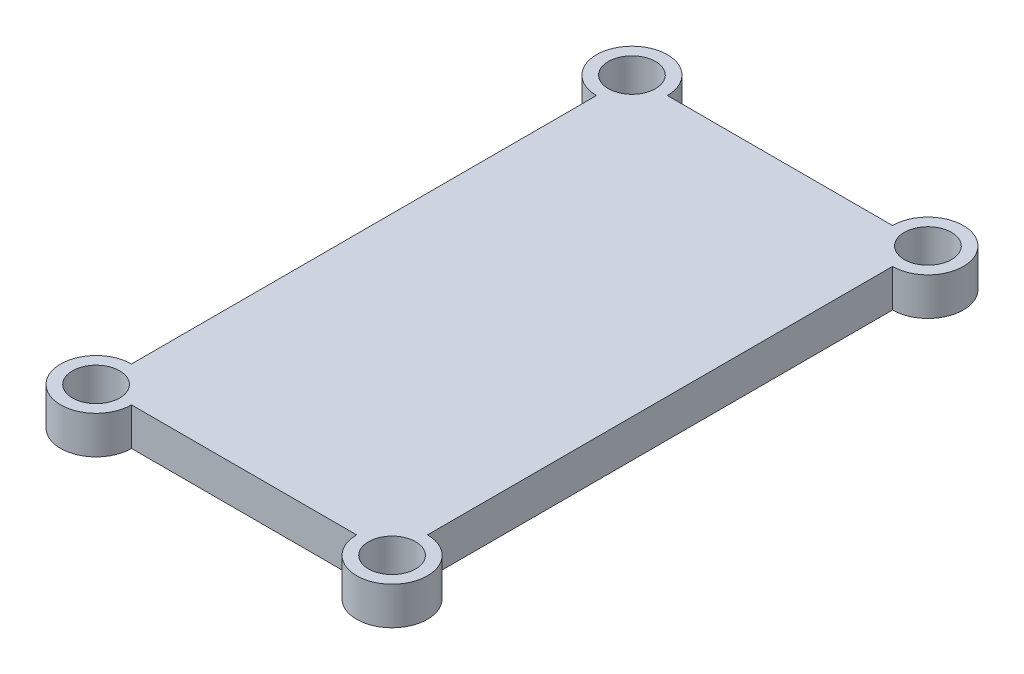
ISO-10303-21;
HEADER;
FILE_DESCRIPTION(('STEP AP214'),'2;1');
FILE_NAME('part.step','',(''),(''),'','','');
FILE_SCHEMA(('AUTOMOTIVE_DESIGN { 1 0 10303 214 1 1 1 1 }'));
ENDSEC;
DATA;
#1=APPLICATION_CONTEXT('core data for automotive mechanical design processes');
#2=APPLICATION_PROTOCOL_DEFINITION('international standard','automotive_design',2000,#1);
#3=PRODUCT_CONTEXT('',#1,'mechanical');
#4=PRODUCT('Part','Part','',(#3));
#5=PRODUCT_RELATED_PRODUCT_CATEGORY('part','',(#4));
#6=PRODUCT_DEFINITION_FORMATION('','',#4);
#7=PRODUCT_DEFINITION_CONTEXT('part definition',#1,'design');
#8=PRODUCT_DEFINITION('design','',#6,#7);
#9=PRODUCT_DEFINITION_SHAPE('','',#8);
#10=(LENGTH_UNIT() NAMED_UNIT(*) SI_UNIT(.MILLI.,.METRE.));
#11=(NAMED_UNIT(*) PLANE_ANGLE_UNIT() SI_UNIT($,.RADIAN.));
#12=(NAMED_UNIT(*) SI_UNIT($,.STERADIAN.) SOLID_ANGLE_UNIT());
#13=UNCERTAINTY_MEASURE_WITH_UNIT(LENGTH_MEASURE(1.E-05),#10,'distance_accuracy_value','');
#14=(GEOMETRIC_REPRESENTATION_CONTEXT(3) GLOBAL_UNCERTAINTY_ASSIGNED_CONTEXT((#13)) GLOBAL_UNIT_ASSIGNED_CONTEXT((#10,
#11,#12)) REPRESENTATION_CONTEXT('',''));
#15=CARTESIAN_POINT('',(0.,0.,0.));
#16=DIRECTION('',(0.,0.,1.));
#17=DIRECTION('',(1.,0.,0.));
#18=AXIS2_PLACEMENT_3D('',#15,#16,#17);
#19=CARTESIAN_POINT('',(543.211650628953,1649.98788435951,1480.0966016738));
#20=DIRECTION('',(0.999999999279789,2.17013928398265E-09,3.79528956250719E-05));
#21=DIRECTION('',(3.79528956250719E-05,0.,-0.999999999279789));
#22=AXIS2_PLACEMENT_3D('',#19,#20,#21);
#23=PLANE('',#22);
#24=DIRECTION('',(-3.79528956250739E-05,9.25094557981496E-10,0.999999999279789));
#25=VECTOR('',#24,1.);
#26=CARTESIAN_POINT('',(543.211650646314,1641.98788435951,1480.0966016812));
#27=LINE('',#26,#25);
#28=CARTESIAN_POINT('',(543.21567365325,1641.98788426145,1374.09660175755));
#29=VERTEX_POINT('',#28);
#30=CARTESIAN_POINT('',(543.211935293031,1641.98788435257,1472.59660168661));
#31=VERTEX_POINT('',#30);
#32=EDGE_CURVE('E114',#29,#31,#27,.T.);
#33=ORIENTED_EDGE('',*,*,#32,.T.);
#34=DIRECTION('',(2.17010561685217E-09,-1.,9.25177898609854E-10));
#35=VECTOR('',#34,1.);
#36=CARTESIAN_POINT('',(543.21193527567,1649.98788435258,1472.5966016792));
#37=LINE('',#36,#35);
#38=CARTESIAN_POINT('',(543.21193527567,1649.98788435257,1472.5966016792));
#39=VERTEX_POINT('',#38);
#40=EDGE_CURVE('E55',#31,#39,#37,.F.);
#41=ORIENTED_EDGE('',*,*,#40,.T.);
#42=DIRECTION('',(-3.79528956250739E-05,9.25094557981496E-10,0.999999999279789));
#43=VECTOR('',#42,1.);
#44=CARTESIAN_POINT('',(543.211650628953,1649.98788435951,1480.0966016738));
#45=LINE('',#44,#43);
#46=CARTESIAN_POINT('',(543.215673635889,1649.98788426145,1374.09660175015));
#47=VERTEX_POINT('',#46);
#48=EDGE_CURVE('E164',#47,#39,#45,.T.);
#49=ORIENTED_EDGE('',*,*,#48,.F.);
#50=DIRECTION('',(2.17010561685217E-09,-1.,9.25177898609854E-10));
#51=VECTOR('',#50,1.);
#52=CARTESIAN_POINT('',(543.215673635889,1649.98788426145,1374.09660175015));
#53=LINE('',#52,#51);
#54=EDGE_CURVE('E162',#47,#29,#53,.T.);
#55=ORIENTED_EDGE('',*,*,#54,.T.);
#56=EDGE_LOOP('',(#33,#41,#49,#55));
#57=FACE_BOUND('',#56,.T.);
#58=ADVANCED_FACE('F39',(#57),#23,.F.);
#59=CARTESIAN_POINT('',(543.211650628953,1649.98788435951,1480.0966016738));
#60=DIRECTION('',(3.79528956233457E-05,-9.25095578059673E-10,-0.999999999279789));
#61=DIRECTION('',(-0.999999999279789,0.,-3.79528956233457E-05));
#62=AXIS2_PLACEMENT_3D('',#59,#60,#61);
#63=PLANE('',#62);
#64=DIRECTION('',(0.999999999279789,2.17014072846945E-09,3.79528956233437E-05));
#65=VECTOR('',#64,1.);
#66=CARTESIAN_POINT('',(543.211650628953,1649.98788435951,1480.0966016738));
#67=LINE('',#66,#65);
#68=CARTESIAN_POINT('',(550.711650623555,1649.98788437579,1480.09688632052));
#69=VERTEX_POINT('',#68);
#70=CARTESIAN_POINT('',(598.411650589201,1649.9878844793,1480.09869667364));
#71=VERTEX_POINT('',#70);
#72=EDGE_CURVE('E63',#69,#71,#67,.T.);
#73=ORIENTED_EDGE('',*,*,#72,.F.);
#74=DIRECTION('',(2.17010561685217E-09,-1.,9.25177898609854E-10));
#75=VECTOR('',#74,1.);
#76=CARTESIAN_POINT('',(550.711650623555,1649.98788437579,1480.09688632052));
#77=LINE('',#76,#75);
#78=CARTESIAN_POINT('',(550.711650640916,1641.98788437579,1480.09688632792));
#79=VERTEX_POINT('',#78);
#80=EDGE_CURVE('E116',#69,#79,#77,.T.);
#81=ORIENTED_EDGE('',*,*,#80,.T.);
#82=DIRECTION('',(0.999999999279789,2.17014072846945E-09,3.79528956233437E-05));
#83=VECTOR('',#82,1.);
#84=CARTESIAN_POINT('',(543.211650646314,1641.98788435951,1480.0966016812));
#85=LINE('',#84,#83);
#86=CARTESIAN_POINT('',(598.411650606562,1641.9878844793,1480.09869668104));
#87=VERTEX_POINT('',#86);
#88=EDGE_CURVE('E105',#79,#87,#85,.T.);
#89=ORIENTED_EDGE('',*,*,#88,.T.);
#90=DIRECTION('',(2.17010561685217E-09,-1.,9.25177898609854E-10));
#91=VECTOR('',#90,1.);
#92=CARTESIAN_POINT('',(598.411650589201,1649.98788447931,1480.09869667364));
#93=LINE('',#92,#91);
#94=EDGE_CURVE('E139',#87,#71,#93,.F.);
#95=ORIENTED_EDGE('',*,*,#94,.T.);
#96=EDGE_LOOP('',(#73,#81,#89,#95));
#97=FACE_BOUND('',#96,.T.);
#98=ADVANCED_FACE('F117',(#97),#63,.F.);
#99=CARTESIAN_POINT('',(605.911650583796,1649.98788449558,1480.09898132036));
#100=DIRECTION('',(-0.999999999279789,-2.17013928398265E-09,-3.79528956250719E-05));
#101=DIRECTION('',(-3.79528956250719E-05,0.,0.999999999279789));
#102=AXIS2_PLACEMENT_3D('',#99,#100,#101);
#103=PLANE('',#102);
#104=DIRECTION('',(3.79528956250739E-05,-9.25096514321628E-10,-0.999999999279789));
#105=VECTOR('',#104,1.);
#106=CARTESIAN_POINT('',(605.911650583796,1649.98788449558,1480.09898132036));
#107=LINE('',#106,#105);
#108=CARTESIAN_POINT('',(605.911935230513,1649.98788448864,1472.59898132576));
#109=VERTEX_POINT('',#108);
#110=CARTESIAN_POINT('',(605.915673590732,1649.98788439752,1374.0989813967));
#111=VERTEX_POINT('',#110);
#112=EDGE_CURVE('E47',#109,#111,#107,.T.);
#113=ORIENTED_EDGE('',*,*,#112,.F.);
#114=DIRECTION('',(2.17010561685217E-09,-1.,9.25177898609854E-10));
#115=VECTOR('',#114,1.);
#116=CARTESIAN_POINT('',(605.911935230513,1649.98788448864,1472.59898132576));
#117=LINE('',#116,#115);
#118=CARTESIAN_POINT('',(605.911935247874,1641.98788448864,1472.59898133316));
#119=VERTEX_POINT('',#118);
#120=EDGE_CURVE('E134',#109,#119,#117,.T.);
#121=ORIENTED_EDGE('',*,*,#120,.T.);
#122=DIRECTION('',(3.79528956250739E-05,-9.25096514321628E-10,-0.999999999279789));
#123=VECTOR('',#122,1.);
#124=CARTESIAN_POINT('',(605.911650601156,1641.98788449558,1480.09898132776));
#125=LINE('',#124,#123);
#126=CARTESIAN_POINT('',(605.915673608093,1641.98788439752,1374.0989814041));
#127=VERTEX_POINT('',#126);
#128=EDGE_CURVE('E113',#119,#127,#125,.T.);
#129=ORIENTED_EDGE('',*,*,#128,.T.);
#130=DIRECTION('',(2.17010561685217E-09,-1.,9.25177898609854E-10));
#131=VECTOR('',#130,1.);
#132=CARTESIAN_POINT('',(605.915673590732,1649.98788439752,1374.0989813967));
#133=LINE('',#132,#131);
#134=EDGE_CURVE('E150',#127,#111,#133,.F.);
#135=ORIENTED_EDGE('',*,*,#134,.T.);
#136=EDGE_LOOP('',(#113,#121,#129,#135));
#137=FACE_BOUND('',#136,.T.);
#138=ADVANCED_FACE('F186',(#137),#103,.F.);
#139=CARTESIAN_POINT('',(543.215958282606,1649.98788425451,1366.59660175555));
#140=DIRECTION('',(-3.79528956233457E-05,9.25095578059673E-10,0.999999999279789));
#141=DIRECTION('',(0.999999999279789,0.,3.79528956233457E-05));
#142=AXIS2_PLACEMENT_3D('',#139,#140,#141);
#143=PLANE('',#142);
#144=DIRECTION('',(-0.999999999279789,-2.17013718708819E-09,-3.79528956233437E-05));
#145=VECTOR('',#144,1.);
#146=CARTESIAN_POINT('',(543.215958282606,1649.98788425451,1366.59660175555));
#147=LINE('',#146,#145);
#148=CARTESIAN_POINT('',(598.415958242854,1649.9878843743,1366.59869675538));
#149=VERTEX_POINT('',#148);
#150=CARTESIAN_POINT('',(550.715958277208,1649.98788427079,1366.59688640226));
#151=VERTEX_POINT('',#150);
#152=EDGE_CURVE('E11',#149,#151,#147,.T.);
#153=ORIENTED_EDGE('',*,*,#152,.F.);
#154=DIRECTION('',(2.17010561685217E-09,-1.,9.25177898609854E-10));
#155=VECTOR('',#154,1.);
#156=CARTESIAN_POINT('',(598.415958242854,1649.98788437431,1366.59869675538));
#157=LINE('',#156,#155);
#158=CARTESIAN_POINT('',(598.415958260215,1641.98788437431,1366.59869676279));
#159=VERTEX_POINT('',#158);
#160=EDGE_CURVE('E145',#149,#159,#157,.T.);
#161=ORIENTED_EDGE('',*,*,#160,.T.);
#162=DIRECTION('',(-0.999999999279789,-2.17013718708819E-09,-3.79528956233437E-05));
#163=VECTOR('',#162,1.);
#164=CARTESIAN_POINT('',(543.215958299967,1641.98788425451,1366.59660176295));
#165=LINE('',#164,#163);
#166=CARTESIAN_POINT('',(550.715958294569,1641.98788427079,1366.59688640966));
#167=VERTEX_POINT('',#166);
#168=EDGE_CURVE('E42',#159,#167,#165,.T.);
#169=ORIENTED_EDGE('',*,*,#168,.T.);
#170=DIRECTION('',(2.17010561685217E-09,-1.,9.25177898609854E-10));
#171=VECTOR('',#170,1.);
#172=CARTESIAN_POINT('',(550.715958277208,1649.98788427079,1366.59688640226));
#173=LINE('',#172,#171);
#174=EDGE_CURVE('E157',#167,#151,#173,.F.);
#175=ORIENTED_EDGE('',*,*,#174,.T.);
#176=EDGE_LOOP('',(#153,#161,#169,#175));
#177=FACE_BOUND('',#176,.T.);
#178=ADVANCED_FACE('F172',(#177),#143,.F.);
#179=CARTESIAN_POINT('',(-3.58064214365673E-06,1649.98788181134,-1.52653071519668E-06));
#180=DIRECTION('',(2.17010207550803E-09,-1.,9.25176920305386E-10));
#181=DIRECTION('',(1.,2.17010207550803E-09,0.));
#182=AXIS2_PLACEMENT_3D('',#179,#180,#181);
#183=PLANE('',#182);
#184=CARTESIAN_POINT('',(543.21595828261,1649.98788425452,1366.59660175555));
#185=DIRECTION('',(2.17010561685217E-09,-1.,9.25177898609854E-10));
#186=DIRECTION('',(1.,2.17010561685217E-09,0.));
#187=AXIS2_PLACEMENT_3D('',#184,#185,#186);
#188=CIRCLE('',#187,5.00000000000009);
#189=CARTESIAN_POINT('',(548.21595828261,1649.98788426537,1366.59660175555));
#190=VERTEX_POINT('',#189);
#191=EDGE_CURVE('E393',#190,#190,#188,.T.);
#192=ORIENTED_EDGE('',*,*,#191,.T.);
#193=EDGE_LOOP('',(#192));
#194=FACE_BOUND('',#193,.T.);
#195=CARTESIAN_POINT('',(605.915958237453,1649.98788439058,1366.5989814021));
#196=DIRECTION('',(2.17010561685217E-09,-1.,9.25177898609854E-10));
#197=DIRECTION('',(1.,2.17010561685217E-09,0.));
#198=AXIS2_PLACEMENT_3D('',#195,#196,#197);
#199=CIRCLE('',#198,5.00000000000002);
#200=CARTESIAN_POINT('',(610.915958237453,1649.98788440143,1366.5989814021));
#201=VERTEX_POINT('',#200);
#202=EDGE_CURVE('E397',#201,#201,#199,.T.);
#203=ORIENTED_EDGE('',*,*,#202,.T.);
#204=EDGE_LOOP('',(#203));
#205=FACE_BOUND('',#204,.T.);
#206=CARTESIAN_POINT('',(605.911650583799,1649.98788449558,1480.09898132036));
#207=DIRECTION('',(2.17010561685217E-09,-1.,9.25177898609854E-10));
#208=DIRECTION('',(1.,2.17010561685217E-09,0.));
#209=AXIS2_PLACEMENT_3D('',#206,#207,#208);
#210=CIRCLE('',#209,5.00000000000002);
#211=CARTESIAN_POINT('',(610.911650583799,1649.98788450643,1480.09898132036));
#212=VERTEX_POINT('',#211);
#213=EDGE_CURVE('E412',#212,#212,#210,.T.);
#214=ORIENTED_EDGE('',*,*,#213,.T.);
#215=EDGE_LOOP('',(#214));
#216=FACE_BOUND('',#215,.T.);
#217=CARTESIAN_POINT('',(543.211650628956,1649.98788435951,1480.0966016738));
#218=DIRECTION('',(2.17010561685217E-09,-1.,9.25177898609854E-10));
#219=DIRECTION('',(1.,2.17010561685217E-09,0.));
#220=AXIS2_PLACEMENT_3D('',#217,#218,#219);
#221=CIRCLE('',#220,5.00000000000009);
#222=CARTESIAN_POINT('',(548.211650628956,1649.98788437036,1480.0966016738));
#223=VERTEX_POINT('',#222);
#224=EDGE_CURVE('E125',#223,#223,#221,.T.);
#225=ORIENTED_EDGE('',*,*,#224,.T.);
#226=EDGE_LOOP('',(#225));
#227=FACE_BOUND('',#226,.T.);
#228=ORIENTED_EDGE('',*,*,#48,.T.);
#229=CARTESIAN_POINT('',(543.211650628956,1649.98788435951,1480.0966016738));
#230=DIRECTION('',(2.17010561685217E-09,-1.,9.25177898609854E-10));
#231=DIRECTION('',(1.,2.17010561685217E-09,0.));
#232=AXIS2_PLACEMENT_3D('',#229,#230,#231);
#233=CIRCLE('',#232,7.50000000000001);
#234=EDGE_CURVE('E123',#69,#39,#233,.T.);
#235=ORIENTED_EDGE('',*,*,#234,.F.);
#236=ORIENTED_EDGE('',*,*,#72,.T.);
#237=CARTESIAN_POINT('',(605.911650583799,1649.98788449558,1480.09898132036));
#238=DIRECTION('',(2.17010561685217E-09,-1.,9.25177898609854E-10));
#239=DIRECTION('',(1.,2.17010561685217E-09,0.));
#240=AXIS2_PLACEMENT_3D('',#237,#238,#239);
#241=CIRCLE('',#240,7.49999999999995);
#242=EDGE_CURVE('E132',#109,#71,#241,.T.);
#243=ORIENTED_EDGE('',*,*,#242,.F.);
#244=ORIENTED_EDGE('',*,*,#112,.T.);
#245=CARTESIAN_POINT('',(605.915958237453,1649.98788439058,1366.5989814021));
#246=DIRECTION('',(2.17010561685217E-09,-1.,9.25177898609854E-10));
#247=DIRECTION('',(1.,2.17010561685217E-09,0.));
#248=AXIS2_PLACEMENT_3D('',#245,#246,#247);
#249=CIRCLE('',#248,7.49999999999995);
#250=EDGE_CURVE('E141',#149,#111,#249,.T.);
#251=ORIENTED_EDGE('',*,*,#250,.F.);
#252=ORIENTED_EDGE('',*,*,#152,.T.);
#253=CARTESIAN_POINT('',(543.21595828261,1649.98788425452,1366.59660175555));
#254=DIRECTION('',(2.17010561685217E-09,-1.,9.25177898609854E-10));
#255=DIRECTION('',(1.,2.17010561685217E-09,0.));
#256=AXIS2_PLACEMENT_3D('',#253,#254,#255);
#257=CIRCLE('',#256,7.50000000000001);
#258=EDGE_CURVE('E154',#47,#151,#257,.T.);
#259=ORIENTED_EDGE('',*,*,#258,.F.);
#260=EDGE_LOOP('',(#228,#235,#236,#243,#244,#251,#252,#259));
#261=FACE_BOUND('',#260,.T.);
#262=ADVANCED_FACE('F181',(#194,#205,#216,#227,#261),#183,.F.);
#263=CARTESIAN_POINT('',(-3.56328131027782E-06,1641.98788181134,-1.51912929167298E-06));
#264=DIRECTION('',(2.17010207550803E-09,-1.,9.25176920305386E-10));
#265=DIRECTION('',(1.,2.17010207550803E-09,0.));
#266=AXIS2_PLACEMENT_3D('',#263,#264,#265);
#267=PLANE('',#266);
#268=CARTESIAN_POINT('',(543.215958299971,1641.98788425452,1366.59660176295));
#269=DIRECTION('',(2.17010561685217E-09,-1.,9.25177898609854E-10));
#270=DIRECTION('',(1.,2.17010561685217E-09,0.));
#271=AXIS2_PLACEMENT_3D('',#268,#269,#270);
#272=CIRCLE('',#271,5.00000000000009);
#273=CARTESIAN_POINT('',(548.215958299971,1641.98788426537,1366.59660176295));
#274=VERTEX_POINT('',#273);
#275=EDGE_CURVE('E396',#274,#274,#272,.T.);
#276=ORIENTED_EDGE('',*,*,#275,.F.);
#277=EDGE_LOOP('',(#276));
#278=FACE_BOUND('',#277,.T.);
#279=CARTESIAN_POINT('',(605.915958254813,1641.98788439058,1366.5989814095));
#280=DIRECTION('',(2.17010561685217E-09,-1.,9.25177898609854E-10));
#281=DIRECTION('',(1.,2.17010561685217E-09,0.));
#282=AXIS2_PLACEMENT_3D('',#279,#280,#281);
#283=CIRCLE('',#282,5.00000000000002);
#284=CARTESIAN_POINT('',(610.915958254813,1641.98788440143,1366.5989814095));
#285=VERTEX_POINT('',#284);
#286=EDGE_CURVE('E400',#285,#285,#283,.T.);
#287=ORIENTED_EDGE('',*,*,#286,.F.);
#288=EDGE_LOOP('',(#287));
#289=FACE_BOUND('',#288,.T.);
#290=CARTESIAN_POINT('',(605.91165060116,1641.98788449558,1480.09898132776));
#291=DIRECTION('',(2.17010561685217E-09,-1.,9.25177898609854E-10));
#292=DIRECTION('',(1.,2.17010561685217E-09,0.));
#293=AXIS2_PLACEMENT_3D('',#290,#291,#292);
#294=CIRCLE('',#293,5.00000000000002);
#295=CARTESIAN_POINT('',(610.91165060116,1641.98788450643,1480.09898132776));
#296=VERTEX_POINT('',#295);
#297=EDGE_CURVE('E408',#296,#296,#294,.T.);
#298=ORIENTED_EDGE('',*,*,#297,.F.);
#299=EDGE_LOOP('',(#298));
#300=FACE_BOUND('',#299,.T.);
#301=CARTESIAN_POINT('',(543.211650646317,1641.98788435951,1480.0966016812));
#302=DIRECTION('',(2.17010561685217E-09,-1.,9.25177898609854E-10));
#303=DIRECTION('',(1.,2.17010561685217E-09,0.));
#304=AXIS2_PLACEMENT_3D('',#301,#302,#303);
#305=CIRCLE('',#304,5.00000000000009);
#306=CARTESIAN_POINT('',(548.211650646317,1641.98788437036,1480.0966016812));
#307=VERTEX_POINT('',#306);
#308=EDGE_CURVE('E128',#307,#307,#305,.T.);
#309=ORIENTED_EDGE('',*,*,#308,.F.);
#310=EDGE_LOOP('',(#309));
#311=FACE_BOUND('',#310,.T.);
#312=ORIENTED_EDGE('',*,*,#88,.F.);
#313=CARTESIAN_POINT('',(543.211650646317,1641.98788435951,1480.0966016812));
#314=DIRECTION('',(2.17010561685217E-09,-1.,9.25177898609854E-10));
#315=DIRECTION('',(1.,2.17010561685217E-09,0.));
#316=AXIS2_PLACEMENT_3D('',#313,#314,#315);
#317=CIRCLE('',#316,7.50000000000001);
#318=EDGE_CURVE('E109',#79,#31,#317,.T.);
#319=ORIENTED_EDGE('',*,*,#318,.T.);
#320=ORIENTED_EDGE('',*,*,#32,.F.);
#321=CARTESIAN_POINT('',(543.215958299971,1641.98788425452,1366.59660176295));
#322=DIRECTION('',(2.17010561685217E-09,-1.,9.25177898609854E-10));
#323=DIRECTION('',(1.,2.17010561685217E-09,0.));
#324=AXIS2_PLACEMENT_3D('',#321,#322,#323);
#325=CIRCLE('',#324,7.50000000000001);
#326=EDGE_CURVE('E153',#29,#167,#325,.T.);
#327=ORIENTED_EDGE('',*,*,#326,.T.);
#328=ORIENTED_EDGE('',*,*,#168,.F.);
#329=CARTESIAN_POINT('',(605.915958254813,1641.98788439058,1366.5989814095));
#330=DIRECTION('',(2.17010561685217E-09,-1.,9.25177898609854E-10));
#331=DIRECTION('',(1.,2.17010561685217E-09,0.));
#332=AXIS2_PLACEMENT_3D('',#329,#330,#331);
#333=CIRCLE('',#332,7.49999999999995);
#334=EDGE_CURVE('E142',#159,#127,#333,.T.);
#335=ORIENTED_EDGE('',*,*,#334,.T.);
#336=ORIENTED_EDGE('',*,*,#128,.F.);
#337=CARTESIAN_POINT('',(605.91165060116,1641.98788449558,1480.09898132776));
#338=DIRECTION('',(2.17010561685217E-09,-1.,9.25177898609854E-10));
#339=DIRECTION('',(1.,2.17010561685217E-09,0.));
#340=AXIS2_PLACEMENT_3D('',#337,#338,#339);
#341=CIRCLE('',#340,7.49999999999995);
#342=EDGE_CURVE('E111',#119,#87,#341,.T.);
#343=ORIENTED_EDGE('',*,*,#342,.T.);
#344=EDGE_LOOP('',(#312,#319,#320,#327,#328,#335,#336,#343));
#345=FACE_BOUND('',#344,.T.);
#346=ADVANCED_FACE('F106',(#278,#289,#300,#311,#345),#267,.T.);
#347=CARTESIAN_POINT('',(543.21595828261,1649.98788425452,1366.59660175555));
#348=DIRECTION('',(2.17010561685217E-09,-1.,9.25177898609854E-10));
#349=DIRECTION('',(1.,2.17010561685217E-09,0.));
#350=AXIS2_PLACEMENT_3D('',#347,#348,#349);
#351=CYLINDRICAL_SURFACE('',#350,7.50000000000001);
#352=ORIENTED_EDGE('',*,*,#54,.F.);
#353=ORIENTED_EDGE('',*,*,#258,.T.);
#354=ORIENTED_EDGE('',*,*,#174,.F.);
#355=ORIENTED_EDGE('',*,*,#326,.F.);
#356=EDGE_LOOP('',(#352,#353,#354,#355));
#357=FACE_BOUND('',#356,.T.);
#358=ADVANCED_FACE('F178',(#357),#351,.T.);
#359=CARTESIAN_POINT('',(605.915958237453,1649.98788439058,1366.5989814021));
#360=DIRECTION('',(2.17010561685217E-09,-1.,9.25177898609854E-10));
#361=DIRECTION('',(1.,2.17010561685217E-09,0.));
#362=AXIS2_PLACEMENT_3D('',#359,#360,#361);
#363=CYLINDRICAL_SURFACE('',#362,7.49999999999995);
#364=ORIENTED_EDGE('',*,*,#134,.F.);
#365=ORIENTED_EDGE('',*,*,#334,.F.);
#366=ORIENTED_EDGE('',*,*,#160,.F.);
#367=ORIENTED_EDGE('',*,*,#250,.T.);
#368=EDGE_LOOP('',(#364,#365,#366,#367));
#369=FACE_BOUND('',#368,.T.);
#370=ADVANCED_FACE('F184',(#369),#363,.T.);
#371=CARTESIAN_POINT('',(605.911650583799,1649.98788449558,1480.09898132036));
#372=DIRECTION('',(2.17010561685217E-09,-1.,9.25177898609854E-10));
#373=DIRECTION('',(1.,2.17010561685217E-09,0.));
#374=AXIS2_PLACEMENT_3D('',#371,#372,#373);
#375=CYLINDRICAL_SURFACE('',#374,7.49999999999995);
#376=ORIENTED_EDGE('',*,*,#94,.F.);
#377=ORIENTED_EDGE('',*,*,#342,.F.);
#378=ORIENTED_EDGE('',*,*,#120,.F.);
#379=ORIENTED_EDGE('',*,*,#242,.T.);
#380=EDGE_LOOP('',(#376,#377,#378,#379));
#381=FACE_BOUND('',#380,.T.);
#382=ADVANCED_FACE('F189',(#381),#375,.T.);
#383=CARTESIAN_POINT('',(543.211650628956,1649.98788435951,1480.0966016738));
#384=DIRECTION('',(2.17010561685217E-09,-1.,9.25177898609854E-10));
#385=DIRECTION('',(1.,2.17010561685217E-09,0.));
#386=AXIS2_PLACEMENT_3D('',#383,#384,#385);
#387=CYLINDRICAL_SURFACE('',#386,7.50000000000001);
#388=ORIENTED_EDGE('',*,*,#40,.F.);
#389=ORIENTED_EDGE('',*,*,#318,.F.);
#390=ORIENTED_EDGE('',*,*,#80,.F.);
#391=ORIENTED_EDGE('',*,*,#234,.T.);
#392=EDGE_LOOP('',(#388,#389,#390,#391));
#393=FACE_BOUND('',#392,.T.);
#394=ADVANCED_FACE('F122',(#393),#387,.T.);
#395=CARTESIAN_POINT('',(543.211650628956,1649.98788435951,1480.0966016738));
#396=DIRECTION('',(2.17010561685217E-09,-1.,9.25177898609854E-10));
#397=DIRECTION('',(1.,2.17010561685217E-09,0.));
#398=AXIS2_PLACEMENT_3D('',#395,#396,#397);
#399=CYLINDRICAL_SURFACE('',#398,5.00000000000009);
#400=ORIENTED_EDGE('',*,*,#224,.F.);
#401=EDGE_LOOP('',(#400));
#402=FACE_BOUND('',#401,.T.);
#403=ORIENTED_EDGE('',*,*,#308,.T.);
#404=EDGE_LOOP('',(#403));
#405=FACE_BOUND('',#404,.T.);
#406=ADVANCED_FACE('F196',(#402,#405),#399,.F.);
#407=CARTESIAN_POINT('',(605.911650583799,1649.98788449558,1480.09898132036));
#408=DIRECTION('',(2.17010561685217E-09,-1.,9.25177898609854E-10));
#409=DIRECTION('',(1.,2.17010561685217E-09,0.));
#410=AXIS2_PLACEMENT_3D('',#407,#408,#409);
#411=CYLINDRICAL_SURFACE('',#410,5.00000000000002);
#412=ORIENTED_EDGE('',*,*,#213,.F.);
#413=EDGE_LOOP('',(#412));
#414=FACE_BOUND('',#413,.T.);
#415=ORIENTED_EDGE('',*,*,#297,.T.);
#416=EDGE_LOOP('',(#415));
#417=FACE_BOUND('',#416,.T.);
#418=ADVANCED_FACE('F245',(#414,#417),#411,.F.);
#419=CARTESIAN_POINT('',(605.915958237453,1649.98788439058,1366.5989814021));
#420=DIRECTION('',(2.17010561685217E-09,-1.,9.25177898609854E-10));
#421=DIRECTION('',(1.,2.17010561685217E-09,0.));
#422=AXIS2_PLACEMENT_3D('',#419,#420,#421);
#423=CYLINDRICAL_SURFACE('',#422,5.00000000000002);
#424=ORIENTED_EDGE('',*,*,#202,.F.);
#425=EDGE_LOOP('',(#424));
#426=FACE_BOUND('',#425,.T.);
#427=ORIENTED_EDGE('',*,*,#286,.T.);
#428=EDGE_LOOP('',(#427));
#429=FACE_BOUND('',#428,.T.);
#430=ADVANCED_FACE('F256',(#426,#429),#423,.F.);
#431=CARTESIAN_POINT('',(543.21595828261,1649.98788425452,1366.59660175555));
#432=DIRECTION('',(2.17010561685217E-09,-1.,9.25177898609854E-10));
#433=DIRECTION('',(1.,2.17010561685217E-09,0.));
#434=AXIS2_PLACEMENT_3D('',#431,#432,#433);
#435=CYLINDRICAL_SURFACE('',#434,5.00000000000009);
#436=ORIENTED_EDGE('',*,*,#191,.F.);
#437=EDGE_LOOP('',(#436));
#438=FACE_BOUND('',#437,.T.);
#439=ORIENTED_EDGE('',*,*,#275,.T.);
#440=EDGE_LOOP('',(#439));
#441=FACE_BOUND('',#440,.T.);
#442=ADVANCED_FACE('F266',(#438,#441),#435,.F.);
#443=CLOSED_SHELL('',(#58,#98,#138,#178,#262,#346,#358,#370,#382,#394,#406,#418,#430,#442));
#444=MANIFOLD_SOLID_BREP('B2',#443);
#445=ADVANCED_BREP_SHAPE_REPRESENTATION('',(#18,#444),#14);
#446=SHAPE_DEFINITION_REPRESENTATION(#9,#445);
ENDSEC;
END-ISO-10303-21;
